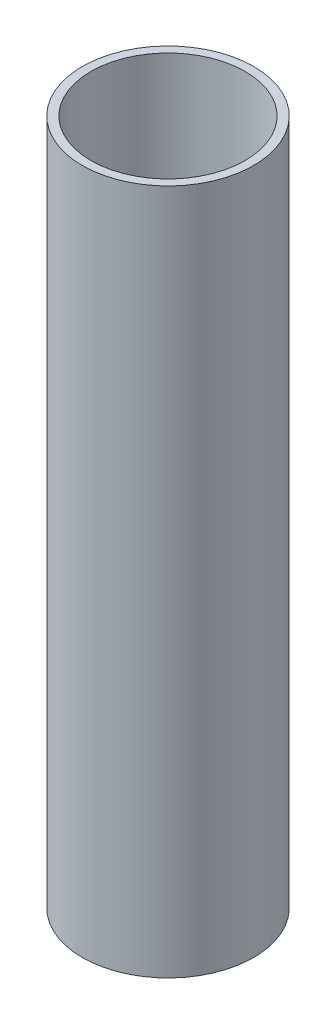
ISO-10303-21;
HEADER;
FILE_DESCRIPTION(('STEP AP214'),'2;1');
FILE_NAME('part.step','',(''),(''),'','','');
FILE_SCHEMA(('AUTOMOTIVE_DESIGN { 1 0 10303 214 1 1 1 1 }'));
ENDSEC;
DATA;
#1=APPLICATION_CONTEXT('core data for automotive mechanical design processes');
#2=APPLICATION_PROTOCOL_DEFINITION('international standard','automotive_design',2000,#1);
#3=PRODUCT_CONTEXT('',#1,'mechanical');
#4=PRODUCT('Part','Part','',(#3));
#5=PRODUCT_RELATED_PRODUCT_CATEGORY('part','',(#4));
#6=PRODUCT_DEFINITION_FORMATION('','',#4);
#7=PRODUCT_DEFINITION_CONTEXT('part definition',#1,'design');
#8=PRODUCT_DEFINITION('design','',#6,#7);
#9=PRODUCT_DEFINITION_SHAPE('','',#8);
#10=(LENGTH_UNIT() NAMED_UNIT(*) SI_UNIT(.MILLI.,.METRE.));
#11=(NAMED_UNIT(*) PLANE_ANGLE_UNIT() SI_UNIT($,.RADIAN.));
#12=(NAMED_UNIT(*) SI_UNIT($,.STERADIAN.) SOLID_ANGLE_UNIT());
#13=UNCERTAINTY_MEASURE_WITH_UNIT(LENGTH_MEASURE(1.E-05),#10,'distance_accuracy_value','');
#14=(GEOMETRIC_REPRESENTATION_CONTEXT(3) GLOBAL_UNCERTAINTY_ASSIGNED_CONTEXT((#13)) GLOBAL_UNIT_ASSIGNED_CONTEXT((#10,
#11,#12)) REPRESENTATION_CONTEXT('',''));
#15=CARTESIAN_POINT('',(0.,0.,0.));
#16=DIRECTION('',(0.,0.,1.));
#17=DIRECTION('',(1.,0.,0.));
#18=AXIS2_PLACEMENT_3D('',#15,#16,#17);
#19=CARTESIAN_POINT('',(0.,200.,0.));
#20=DIRECTION('',(0.,1.,0.));
#21=DIRECTION('',(0.,0.,1.));
#22=AXIS2_PLACEMENT_3D('',#19,#20,#21);
#23=PLANE('',#22);
#24=CARTESIAN_POINT('',(0.,200.,0.));
#25=DIRECTION('',(0.,1.,0.));
#26=DIRECTION('',(0.,0.,1.));
#27=AXIS2_PLACEMENT_3D('',#24,#25,#26);
#28=CIRCLE('',#27,25.);
#29=CARTESIAN_POINT('',(0.,200.,25.));
#30=VERTEX_POINT('',#29);
#31=EDGE_CURVE('E10',#30,#30,#28,.T.);
#32=ORIENTED_EDGE('',*,*,#31,.T.);
#33=EDGE_LOOP('',(#32));
#34=FACE_BOUND('',#33,.T.);
#35=CARTESIAN_POINT('',(0.,200.,0.));
#36=DIRECTION('',(0.,1.,0.));
#37=DIRECTION('',(0.,0.,1.));
#38=AXIS2_PLACEMENT_3D('',#35,#36,#37);
#39=CIRCLE('',#38,22.5);
#40=CARTESIAN_POINT('',(0.,200.,22.5));
#41=VERTEX_POINT('',#40);
#42=EDGE_CURVE('E56',#41,#41,#39,.T.);
#43=ORIENTED_EDGE('',*,*,#42,.F.);
#44=EDGE_LOOP('',(#43));
#45=FACE_BOUND('',#44,.T.);
#46=ADVANCED_FACE('F43',(#34,#45),#23,.T.);
#47=CARTESIAN_POINT('',(0.,0.,0.));
#48=DIRECTION('',(0.,1.,0.));
#49=DIRECTION('',(0.,0.,1.));
#50=AXIS2_PLACEMENT_3D('',#47,#48,#49);
#51=PLANE('',#50);
#52=CARTESIAN_POINT('',(0.,0.,0.));
#53=DIRECTION('',(0.,1.,0.));
#54=DIRECTION('',(0.,0.,1.));
#55=AXIS2_PLACEMENT_3D('',#52,#53,#54);
#56=CIRCLE('',#55,25.);
#57=CARTESIAN_POINT('',(0.,0.,25.));
#58=VERTEX_POINT('',#57);
#59=EDGE_CURVE('E47',#58,#58,#56,.T.);
#60=ORIENTED_EDGE('',*,*,#59,.F.);
#61=EDGE_LOOP('',(#60));
#62=FACE_BOUND('',#61,.T.);
#63=CARTESIAN_POINT('',(0.,0.,0.));
#64=DIRECTION('',(0.,1.,0.));
#65=DIRECTION('',(0.,0.,1.));
#66=AXIS2_PLACEMENT_3D('',#63,#64,#65);
#67=CIRCLE('',#66,22.5);
#68=CARTESIAN_POINT('',(0.,0.,22.5));
#69=VERTEX_POINT('',#68);
#70=EDGE_CURVE('E58',#69,#69,#67,.T.);
#71=ORIENTED_EDGE('',*,*,#70,.T.);
#72=EDGE_LOOP('',(#71));
#73=FACE_BOUND('',#72,.T.);
#74=ADVANCED_FACE('F70',(#62,#73),#51,.F.);
#75=CARTESIAN_POINT('',(0.,200.,0.));
#76=DIRECTION('',(0.,-1.,0.));
#77=DIRECTION('',(0.,0.,-1.));
#78=AXIS2_PLACEMENT_3D('',#75,#76,#77);
#79=CYLINDRICAL_SURFACE('',#78,25.);
#80=ORIENTED_EDGE('',*,*,#31,.F.);
#81=EDGE_LOOP('',(#80));
#82=FACE_BOUND('',#81,.T.);
#83=ORIENTED_EDGE('',*,*,#59,.T.);
#84=EDGE_LOOP('',(#83));
#85=FACE_BOUND('',#84,.T.);
#86=ADVANCED_FACE('F45',(#82,#85),#79,.T.);
#87=CARTESIAN_POINT('',(0.,200.,0.));
#88=DIRECTION('',(0.,-1.,0.));
#89=DIRECTION('',(0.,0.,-1.));
#90=AXIS2_PLACEMENT_3D('',#87,#88,#89);
#91=CYLINDRICAL_SURFACE('',#90,22.5);
#92=ORIENTED_EDGE('',*,*,#42,.T.);
#93=EDGE_LOOP('',(#92));
#94=FACE_BOUND('',#93,.T.);
#95=ORIENTED_EDGE('',*,*,#70,.F.);
#96=EDGE_LOOP('',(#95));
#97=FACE_BOUND('',#96,.T.);
#98=ADVANCED_FACE('F66',(#94,#97),#91,.F.);
#99=CLOSED_SHELL('',(#46,#74,#86,#98));
#100=MANIFOLD_SOLID_BREP('B2',#99);
#101=ADVANCED_BREP_SHAPE_REPRESENTATION('',(#18,#100),#14);
#102=SHAPE_DEFINITION_REPRESENTATION(#9,#101);
ENDSEC;
END-ISO-10303-21;
